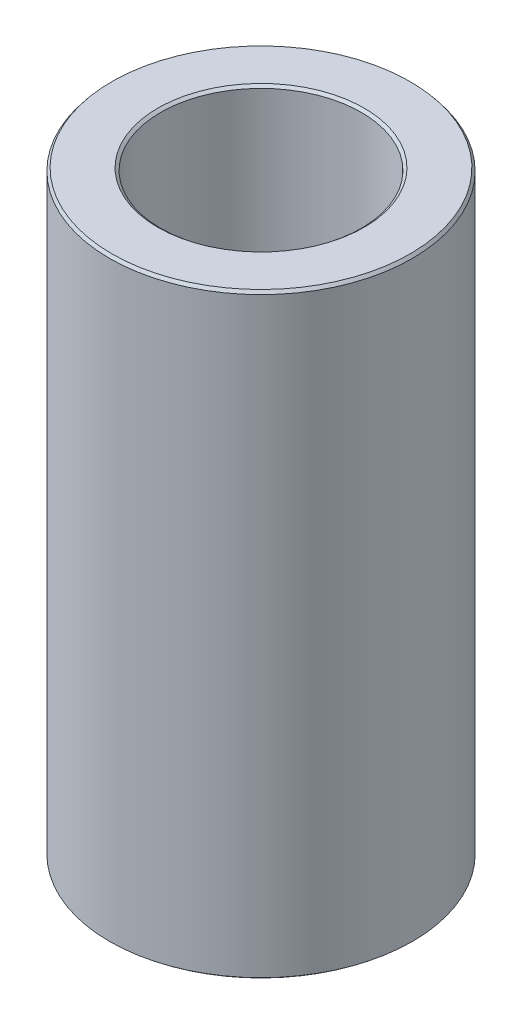
ISO-10303-21;
HEADER;
FILE_DESCRIPTION(('STEP AP214'),'2;1');
FILE_NAME('part.step','',(''),(''),'','','');
FILE_SCHEMA(('AUTOMOTIVE_DESIGN { 1 0 10303 214 1 1 1 1 }'));
ENDSEC;
DATA;
#1=APPLICATION_CONTEXT('core data for automotive mechanical design processes');
#2=APPLICATION_PROTOCOL_DEFINITION('international standard','automotive_design',2000,#1);
#3=PRODUCT_CONTEXT('',#1,'mechanical');
#4=PRODUCT('Part','Part','',(#3));
#5=PRODUCT_RELATED_PRODUCT_CATEGORY('part','',(#4));
#6=PRODUCT_DEFINITION_FORMATION('','',#4);
#7=PRODUCT_DEFINITION_CONTEXT('part definition',#1,'design');
#8=PRODUCT_DEFINITION('design','',#6,#7);
#9=PRODUCT_DEFINITION_SHAPE('','',#8);
#10=(LENGTH_UNIT() NAMED_UNIT(*) SI_UNIT(.MILLI.,.METRE.));
#11=(NAMED_UNIT(*) PLANE_ANGLE_UNIT() SI_UNIT($,.RADIAN.));
#12=(NAMED_UNIT(*) SI_UNIT($,.STERADIAN.) SOLID_ANGLE_UNIT());
#13=UNCERTAINTY_MEASURE_WITH_UNIT(LENGTH_MEASURE(1.E-05),#10,'distance_accuracy_value','');
#14=(GEOMETRIC_REPRESENTATION_CONTEXT(3) GLOBAL_UNCERTAINTY_ASSIGNED_CONTEXT((#13)) GLOBAL_UNIT_ASSIGNED_CONTEXT((#10,
#11,#12)) REPRESENTATION_CONTEXT('',''));
#15=CARTESIAN_POINT('',(0.,0.,0.));
#16=DIRECTION('',(0.,0.,1.));
#17=DIRECTION('',(1.,0.,0.));
#18=AXIS2_PLACEMENT_3D('',#15,#16,#17);
#19=CARTESIAN_POINT('',(0.,177.316452727297,0.));
#20=DIRECTION('',(0.,-1.,0.));
#21=DIRECTION('',(0.,0.,-1.));
#22=AXIS2_PLACEMENT_3D('',#19,#20,#21);
#23=CYLINDRICAL_SURFACE('',#22,45.);
#24=CARTESIAN_POINT('',(0.,0.673131119378056,0.));
#25=DIRECTION('',(0.,1.,0.));
#26=DIRECTION('',(0.,0.,1.));
#27=AXIS2_PLACEMENT_3D('',#24,#25,#26);
#28=CIRCLE('',#27,45.);
#29=CARTESIAN_POINT('',(0.,0.673131119378056,45.));
#30=VERTEX_POINT('',#29);
#31=EDGE_CURVE('E10',#30,#30,#28,.T.);
#32=ORIENTED_EDGE('',*,*,#31,.T.);
#33=EDGE_LOOP('',(#32));
#34=FACE_BOUND('',#33,.T.);
#35=CARTESIAN_POINT('',(0.,176.470774807973,0.));
#36=DIRECTION('',(0.,1.,0.));
#37=DIRECTION('',(0.,0.,1.));
#38=AXIS2_PLACEMENT_3D('',#35,#36,#37);
#39=CIRCLE('',#38,45.);
#40=CARTESIAN_POINT('',(0.,176.470774807973,45.));
#41=VERTEX_POINT('',#40);
#42=EDGE_CURVE('E50',#41,#41,#39,.F.);
#43=ORIENTED_EDGE('',*,*,#42,.T.);
#44=EDGE_LOOP('',(#43));
#45=FACE_BOUND('',#44,.T.);
#46=ADVANCED_FACE('F39',(#34,#45),#23,.T.);
#47=CARTESIAN_POINT('',(0.,177.316452727297,0.));
#48=DIRECTION('',(0.,1.,0.));
#49=DIRECTION('',(0.,0.,1.));
#50=AXIS2_PLACEMENT_3D('',#47,#48,#49);
#51=PLANE('',#50);
#52=CARTESIAN_POINT('',(0.,177.316452727297,0.));
#53=DIRECTION('',(0.,1.,0.));
#54=DIRECTION('',(0.,0.,1.));
#55=AXIS2_PLACEMENT_3D('',#52,#53,#54);
#56=CIRCLE('',#55,30.6812524878567);
#57=CARTESIAN_POINT('',(0.,177.316452727297,30.6812524878567));
#58=VERTEX_POINT('',#57);
#59=EDGE_CURVE('E58',#58,#58,#56,.F.);
#60=ORIENTED_EDGE('',*,*,#59,.T.);
#61=EDGE_LOOP('',(#60));
#62=FACE_BOUND('',#61,.T.);
#63=CARTESIAN_POINT('',(0.,177.316452727297,0.));
#64=DIRECTION('',(0.,1.,0.));
#65=DIRECTION('',(0.,0.,1.));
#66=AXIS2_PLACEMENT_3D('',#63,#64,#65);
#67=CIRCLE('',#66,44.3268688806219);
#68=CARTESIAN_POINT('',(0.,177.316452727297,44.3268688806219));
#69=VERTEX_POINT('',#68);
#70=EDGE_CURVE('E61',#69,#69,#67,.T.);
#71=ORIENTED_EDGE('',*,*,#70,.T.);
#72=EDGE_LOOP('',(#71));
#73=FACE_BOUND('',#72,.T.);
#74=ADVANCED_FACE('F88',(#62,#73),#51,.T.);
#75=CARTESIAN_POINT('',(0.,0.,0.));
#76=DIRECTION('',(0.,1.,0.));
#77=DIRECTION('',(0.,0.,1.));
#78=AXIS2_PLACEMENT_3D('',#75,#76,#77);
#79=PLANE('',#78);
#80=CARTESIAN_POINT('',(0.,0.,0.));
#81=DIRECTION('',(0.,1.,0.));
#82=DIRECTION('',(0.,0.,1.));
#83=AXIS2_PLACEMENT_3D('',#80,#81,#82);
#84=CIRCLE('',#83,30.5087056879102);
#85=CARTESIAN_POINT('',(0.,0.,30.5087056879102));
#86=VERTEX_POINT('',#85);
#87=EDGE_CURVE('E51',#86,#86,#84,.T.);
#88=ORIENTED_EDGE('',*,*,#87,.T.);
#89=EDGE_LOOP('',(#88));
#90=FACE_BOUND('',#89,.T.);
#91=CARTESIAN_POINT('',(0.,0.,0.));
#92=DIRECTION('',(0.,1.,0.));
#93=DIRECTION('',(0.,0.,1.));
#94=AXIS2_PLACEMENT_3D('',#91,#92,#93);
#95=CIRCLE('',#94,44.1543220806755);
#96=CARTESIAN_POINT('',(0.,0.,44.1543220806755));
#97=VERTEX_POINT('',#96);
#98=EDGE_CURVE('E54',#97,#97,#95,.F.);
#99=ORIENTED_EDGE('',*,*,#98,.T.);
#100=EDGE_LOOP('',(#99));
#101=FACE_BOUND('',#100,.T.);
#102=ADVANCED_FACE('F83',(#90,#101),#79,.F.);
#103=CARTESIAN_POINT('',(0.,177.316452727297,0.));
#104=DIRECTION('',(0.,-1.,0.));
#105=DIRECTION('',(0.,0.,-1.));
#106=AXIS2_PLACEMENT_3D('',#103,#104,#105);
#107=CYLINDRICAL_SURFACE('',#106,29.8355745685322);
#108=CARTESIAN_POINT('',(0.,176.643321607919,0.));
#109=DIRECTION('',(0.,1.,0.));
#110=DIRECTION('',(0.,0.,1.));
#111=AXIS2_PLACEMENT_3D('',#108,#109,#110);
#112=CIRCLE('',#111,29.8355745685322);
#113=CARTESIAN_POINT('',(0.,176.643321607919,29.8355745685322));
#114=VERTEX_POINT('',#113);
#115=EDGE_CURVE('E67',#114,#114,#112,.T.);
#116=ORIENTED_EDGE('',*,*,#115,.T.);
#117=EDGE_LOOP('',(#116));
#118=FACE_BOUND('',#117,.T.);
#119=CARTESIAN_POINT('',(0.,0.845677919324467,0.));
#120=DIRECTION('',(0.,1.,0.));
#121=DIRECTION('',(0.,0.,1.));
#122=AXIS2_PLACEMENT_3D('',#119,#120,#121);
#123=CIRCLE('',#122,29.8355745685322);
#124=CARTESIAN_POINT('',(0.,0.845677919324467,29.8355745685322));
#125=VERTEX_POINT('',#124);
#126=EDGE_CURVE('E69',#125,#125,#123,.F.);
#127=ORIENTED_EDGE('',*,*,#126,.T.);
#128=EDGE_LOOP('',(#127));
#129=FACE_BOUND('',#128,.T.);
#130=ADVANCED_FACE('F71',(#118,#129),#107,.F.);
#131=CARTESIAN_POINT('',(0.,176.643321607919,0.));
#132=DIRECTION('',(0.,1.,0.));
#133=DIRECTION('',(0.,0.,1.));
#134=AXIS2_PLACEMENT_3D('',#131,#132,#133);
#135=CONICAL_SURFACE('',#134,29.8355745685322,0.898519805556154);
#136=ORIENTED_EDGE('',*,*,#59,.F.);
#137=EDGE_LOOP('',(#136));
#138=FACE_BOUND('',#137,.T.);
#139=ORIENTED_EDGE('',*,*,#115,.F.);
#140=EDGE_LOOP('',(#139));
#141=FACE_BOUND('',#140,.T.);
#142=ADVANCED_FACE('F77',(#138,#141),#135,.F.);
#143=CARTESIAN_POINT('',(0.,0.,0.));
#144=DIRECTION('',(0.,-1.,0.));
#145=DIRECTION('',(0.,0.,-1.));
#146=AXIS2_PLACEMENT_3D('',#143,#144,#145);
#147=CONICAL_SURFACE('',#146,30.5087056879102,0.672276521238751);
#148=ORIENTED_EDGE('',*,*,#126,.F.);
#149=EDGE_LOOP('',(#148));
#150=FACE_BOUND('',#149,.T.);
#151=ORIENTED_EDGE('',*,*,#87,.F.);
#152=EDGE_LOOP('',(#151));
#153=FACE_BOUND('',#152,.T.);
#154=ADVANCED_FACE('F73',(#150,#153),#147,.F.);
#155=CARTESIAN_POINT('',(0.,0.673131119378056,0.));
#156=DIRECTION('',(0.,1.,0.));
#157=DIRECTION('',(0.,0.,1.));
#158=AXIS2_PLACEMENT_3D('',#155,#156,#157);
#159=CONICAL_SURFACE('',#158,45.,0.898519805556152);
#160=ORIENTED_EDGE('',*,*,#98,.F.);
#161=EDGE_LOOP('',(#160));
#162=FACE_BOUND('',#161,.T.);
#163=ORIENTED_EDGE('',*,*,#31,.F.);
#164=EDGE_LOOP('',(#163));
#165=FACE_BOUND('',#164,.T.);
#166=ADVANCED_FACE('F76',(#162,#165),#159,.T.);
#167=CARTESIAN_POINT('',(0.,177.316452727297,0.));
#168=DIRECTION('',(0.,-1.,0.));
#169=DIRECTION('',(0.,0.,-1.));
#170=AXIS2_PLACEMENT_3D('',#167,#168,#169);
#171=CONICAL_SURFACE('',#170,44.3268688806219,0.672276521238739);
#172=ORIENTED_EDGE('',*,*,#42,.F.);
#173=EDGE_LOOP('',(#172));
#174=FACE_BOUND('',#173,.T.);
#175=ORIENTED_EDGE('',*,*,#70,.F.);
#176=EDGE_LOOP('',(#175));
#177=FACE_BOUND('',#176,.T.);
#178=ADVANCED_FACE('F45',(#174,#177),#171,.T.);
#179=CLOSED_SHELL('',(#46,#74,#102,#130,#142,#154,#166,#178));
#180=MANIFOLD_SOLID_BREP('B2',#179);
#181=ADVANCED_BREP_SHAPE_REPRESENTATION('',(#18,#180),#14);
#182=SHAPE_DEFINITION_REPRESENTATION(#9,#181);
ENDSEC;
END-ISO-10303-21;
